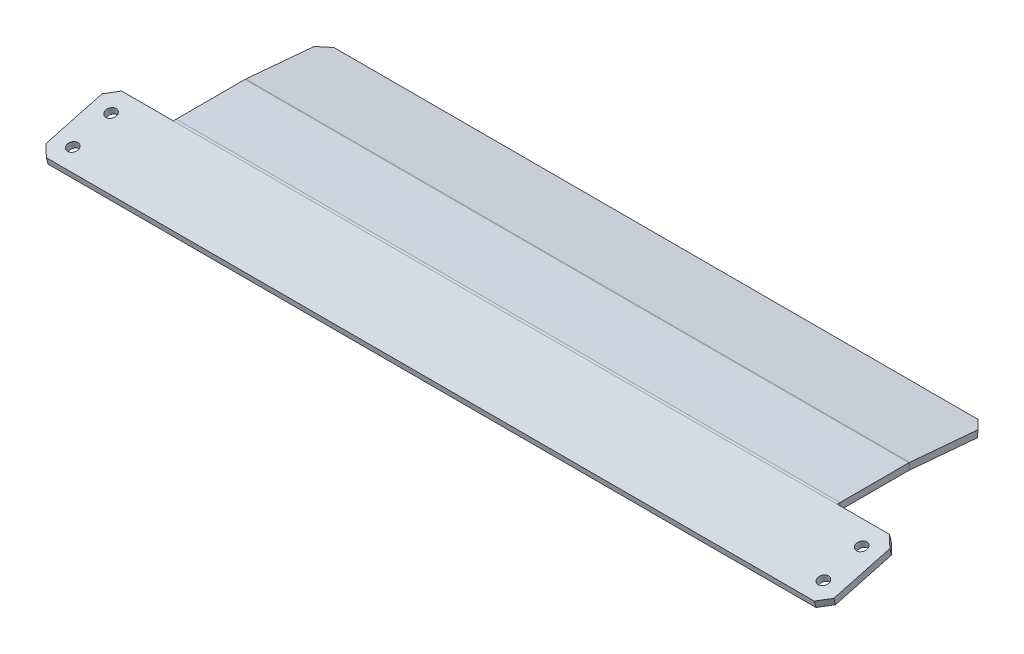
ISO-10303-21;
HEADER;
FILE_DESCRIPTION(('STEP AP214'),'2;1');
FILE_NAME('part.step','',(''),(''),'','','');
FILE_SCHEMA(('AUTOMOTIVE_DESIGN { 1 0 10303 214 1 1 1 1 }'));
ENDSEC;
DATA;
#1=APPLICATION_CONTEXT('core data for automotive mechanical design processes');
#2=APPLICATION_PROTOCOL_DEFINITION('international standard','automotive_design',2000,#1);
#3=PRODUCT_CONTEXT('',#1,'mechanical');
#4=PRODUCT('Part','Part','',(#3));
#5=PRODUCT_RELATED_PRODUCT_CATEGORY('part','',(#4));
#6=PRODUCT_DEFINITION_FORMATION('','',#4);
#7=PRODUCT_DEFINITION_CONTEXT('part definition',#1,'design');
#8=PRODUCT_DEFINITION('design','',#6,#7);
#9=PRODUCT_DEFINITION_SHAPE('','',#8);
#10=(LENGTH_UNIT() NAMED_UNIT(*) SI_UNIT(.MILLI.,.METRE.));
#11=(NAMED_UNIT(*) PLANE_ANGLE_UNIT() SI_UNIT($,.RADIAN.));
#12=(NAMED_UNIT(*) SI_UNIT($,.STERADIAN.) SOLID_ANGLE_UNIT());
#13=UNCERTAINTY_MEASURE_WITH_UNIT(LENGTH_MEASURE(1.E-05),#10,'distance_accuracy_value','');
#14=(GEOMETRIC_REPRESENTATION_CONTEXT(3) GLOBAL_UNCERTAINTY_ASSIGNED_CONTEXT((#13)) GLOBAL_UNIT_ASSIGNED_CONTEXT((#10,
#11,#12)) REPRESENTATION_CONTEXT('',''));
#15=CARTESIAN_POINT('',(0.,0.,0.));
#16=DIRECTION('',(0.,0.,1.));
#17=DIRECTION('',(1.,0.,0.));
#18=AXIS2_PLACEMENT_3D('',#15,#16,#17);
#19=CARTESIAN_POINT('',(0.,-4.2672,0.));
#20=DIRECTION('',(0.,-1.,0.));
#21=DIRECTION('',(0.,0.,-1.));
#22=AXIS2_PLACEMENT_3D('',#19,#20,#21);
#23=PLANE('',#22);
#24=DIRECTION('',(0.,0.,1.));
#25=VECTOR('',#24,1.);
#26=CARTESIAN_POINT('',(-212.725,-4.2672,-22.225));
#27=LINE('',#26,#25);
#28=CARTESIAN_POINT('',(-212.725,-4.2672,-22.1362809640099));
#29=VERTEX_POINT('',#28);
#30=CARTESIAN_POINT('',(-212.725,-4.2672,21.9574821249025));
#31=VERTEX_POINT('',#30);
#32=EDGE_CURVE('E293',#29,#31,#27,.T.);
#33=ORIENTED_EDGE('',*,*,#32,.F.);
#34=DIRECTION('',(1.,0.,0.));
#35=VECTOR('',#34,1.);
#36=CARTESIAN_POINT('',(212.725,-4.2672,-22.1362809640099));
#37=LINE('',#36,#35);
#38=CARTESIAN_POINT('',(212.725,-4.2672,-22.1362809640099));
#39=VERTEX_POINT('',#38);
#40=EDGE_CURVE('E226',#39,#29,#37,.F.);
#41=ORIENTED_EDGE('',*,*,#40,.F.);
#42=DIRECTION('',(0.,0.,-1.));
#43=VECTOR('',#42,1.);
#44=CARTESIAN_POINT('',(212.725,-4.2672,-22.225));
#45=LINE('',#44,#43);
#46=CARTESIAN_POINT('',(212.725,-4.2672,21.9574821249025));
#47=VERTEX_POINT('',#46);
#48=EDGE_CURVE('E295',#47,#39,#45,.T.);
#49=ORIENTED_EDGE('',*,*,#48,.F.);
#50=DIRECTION('',(-1.,0.,0.));
#51=VECTOR('',#50,1.);
#52=CARTESIAN_POINT('',(-212.725,-4.26720000000073,21.9574821249025));
#53=LINE('',#52,#51);
#54=EDGE_CURVE('E274',#31,#47,#53,.F.);
#55=ORIENTED_EDGE('',*,*,#54,.F.);
#56=EDGE_LOOP('',(#33,#41,#49,#55));
#57=FACE_BOUND('',#56,.T.);
#58=ADVANCED_FACE('F38',(#57),#23,.T.);
#59=CARTESIAN_POINT('',(0.,0.,0.));
#60=DIRECTION('',(0.,-1.,0.));
#61=DIRECTION('',(0.,0.,-1.));
#62=AXIS2_PLACEMENT_3D('',#59,#60,#61);
#63=PLANE('',#62);
#64=DIRECTION('',(1.,0.,0.));
#65=VECTOR('',#64,1.);
#66=CARTESIAN_POINT('',(212.725,0.,-22.13628096401));
#67=LINE('',#66,#65);
#68=CARTESIAN_POINT('',(212.725,0.,-22.13628096401));
#69=VERTEX_POINT('',#68);
#70=CARTESIAN_POINT('',(-212.725,0.,-22.1362809640099));
#71=VERTEX_POINT('',#70);
#72=EDGE_CURVE('E187',#69,#71,#67,.F.);
#73=ORIENTED_EDGE('',*,*,#72,.T.);
#74=DIRECTION('',(0.,0.,1.));
#75=VECTOR('',#74,1.);
#76=CARTESIAN_POINT('',(-212.725,0.,-22.225));
#77=LINE('',#76,#75);
#78=CARTESIAN_POINT('',(-212.725,-7.32053306862213E-13,21.9574821249026));
#79=VERTEX_POINT('',#78);
#80=EDGE_CURVE('E290',#71,#79,#77,.T.);
#81=ORIENTED_EDGE('',*,*,#80,.T.);
#82=DIRECTION('',(-1.,0.,0.));
#83=VECTOR('',#82,1.);
#84=CARTESIAN_POINT('',(-212.725,-7.32053306862213E-13,21.9574821249026));
#85=LINE('',#84,#83);
#86=CARTESIAN_POINT('',(212.725,0.,21.9574821249025));
#87=VERTEX_POINT('',#86);
#88=EDGE_CURVE('E260',#79,#87,#85,.F.);
#89=ORIENTED_EDGE('',*,*,#88,.T.);
#90=DIRECTION('',(0.,0.,-1.));
#91=VECTOR('',#90,1.);
#92=CARTESIAN_POINT('',(212.725,0.,-22.225));
#93=LINE('',#92,#91);
#94=EDGE_CURVE('E296',#87,#69,#93,.T.);
#95=ORIENTED_EDGE('',*,*,#94,.T.);
#96=EDGE_LOOP('',(#73,#81,#89,#95));
#97=FACE_BOUND('',#96,.T.);
#98=ADVANCED_FACE('F420',(#97),#63,.F.);
#99=CARTESIAN_POINT('',(212.725,-4.2672,-22.225));
#100=DIRECTION('',(1.,0.,0.));
#101=DIRECTION('',(0.,0.,-1.));
#102=AXIS2_PLACEMENT_3D('',#99,#100,#101);
#103=PLANE('',#102);
#104=ORIENTED_EDGE('',*,*,#48,.T.);
#105=DIRECTION('',(0.,1.,0.));
#106=VECTOR('',#105,1.);
#107=CARTESIAN_POINT('',(212.725,-4.2672,-22.1362809640099));
#108=LINE('',#107,#106);
#109=EDGE_CURVE('E222',#39,#69,#108,.T.);
#110=ORIENTED_EDGE('',*,*,#109,.T.);
#111=ORIENTED_EDGE('',*,*,#94,.F.);
#112=DIRECTION('',(0.,1.,0.));
#113=VECTOR('',#112,1.);
#114=CARTESIAN_POINT('',(212.725,-4.26720000000001,21.9574821249025));
#115=LINE('',#114,#113);
#116=EDGE_CURVE('E281',#47,#87,#115,.T.);
#117=ORIENTED_EDGE('',*,*,#116,.F.);
#118=EDGE_LOOP('',(#104,#110,#111,#117));
#119=FACE_BOUND('',#118,.T.);
#120=ADVANCED_FACE('F426',(#119),#103,.T.);
#121=CARTESIAN_POINT('',(-212.725,-4.2672,-22.225));
#122=DIRECTION('',(-1.,0.,0.));
#123=DIRECTION('',(0.,0.,1.));
#124=AXIS2_PLACEMENT_3D('',#121,#122,#123);
#125=PLANE('',#124);
#126=DIRECTION('',(0.,1.,0.));
#127=VECTOR('',#126,1.);
#128=CARTESIAN_POINT('',(-212.725,-4.2672,-22.1362809640099));
#129=LINE('',#128,#127);
#130=EDGE_CURVE('E230',#29,#71,#129,.T.);
#131=ORIENTED_EDGE('',*,*,#130,.F.);
#132=ORIENTED_EDGE('',*,*,#32,.T.);
#133=DIRECTION('',(0.,1.,0.));
#134=VECTOR('',#133,1.);
#135=CARTESIAN_POINT('',(-212.725,-4.26720000000073,21.9574821249025));
#136=LINE('',#135,#134);
#137=EDGE_CURVE('E265',#31,#79,#136,.T.);
#138=ORIENTED_EDGE('',*,*,#137,.T.);
#139=ORIENTED_EDGE('',*,*,#80,.F.);
#140=EDGE_LOOP('',(#131,#132,#138,#139));
#141=FACE_BOUND('',#140,.T.);
#142=ADVANCED_FACE('F435',(#141),#125,.T.);
#143=CARTESIAN_POINT('',(212.725,-6.29919999999943,21.9574821249025));
#144=DIRECTION('',(1.,0.,0.));
#145=DIRECTION('',(0.,1.,0.));
#146=AXIS2_PLACEMENT_3D('',#143,#144,#145);
#147=PLANE('',#146);
#148=DIRECTION('',(0.,0.96592582628907,0.258819045102515));
#149=VECTOR('',#148,1.);
#150=CARTESIAN_POINT('',(212.725,-4.3364387209806,22.4834024245506));
#151=LINE('',#150,#149);
#152=CARTESIAN_POINT('',(212.725,-4.3364387209806,22.4834024245506));
#153=VERTEX_POINT('',#152);
#154=CARTESIAN_POINT('',(212.725,-0.214640035039874,23.5878350538121));
#155=VERTEX_POINT('',#154);
#156=EDGE_CURVE('E284',#153,#155,#151,.T.);
#157=ORIENTED_EDGE('',*,*,#156,.F.);
#158=CARTESIAN_POINT('',(212.725,-6.29919999999943,21.9574821249025));
#159=DIRECTION('',(-1.,0.,0.));
#160=DIRECTION('',(0.,-1.,0.));
#161=AXIS2_PLACEMENT_3D('',#158,#159,#160);
#162=CIRCLE('',#161,2.03199999999942);
#163=EDGE_CURVE('E269',#47,#153,#162,.F.);
#164=ORIENTED_EDGE('',*,*,#163,.F.);
#165=ORIENTED_EDGE('',*,*,#116,.T.);
#166=CARTESIAN_POINT('',(212.725,-6.29919999999943,21.9574821249025));
#167=DIRECTION('',(-1.,0.,0.));
#168=DIRECTION('',(0.,-1.,0.));
#169=AXIS2_PLACEMENT_3D('',#166,#167,#168);
#170=CIRCLE('',#169,6.29919999999942);
#171=EDGE_CURVE('E262',#87,#155,#170,.F.);
#172=ORIENTED_EDGE('',*,*,#171,.T.);
#173=EDGE_LOOP('',(#157,#164,#165,#172));
#174=FACE_BOUND('',#173,.T.);
#175=ADVANCED_FACE('F439',(#174),#147,.T.);
#176=CARTESIAN_POINT('',(-212.725,-6.29920000000015,21.9574821249025));
#177=DIRECTION('',(1.,0.,0.));
#178=DIRECTION('',(0.,1.,0.));
#179=AXIS2_PLACEMENT_3D('',#176,#177,#178);
#180=PLANE('',#179);
#181=CARTESIAN_POINT('',(-212.725,-6.29920000000015,21.9574821249025));
#182=DIRECTION('',(-1.,0.,0.));
#183=DIRECTION('',(0.,-1.,0.));
#184=AXIS2_PLACEMENT_3D('',#181,#182,#183);
#185=CIRCLE('',#184,2.03199999999942);
#186=CARTESIAN_POINT('',(-212.725,-4.33643872098132,22.4834024245506));
#187=VERTEX_POINT('',#186);
#188=EDGE_CURVE('E277',#187,#31,#185,.T.);
#189=ORIENTED_EDGE('',*,*,#188,.F.);
#190=DIRECTION('',(0.,0.96592582628907,0.258819045102515));
#191=VECTOR('',#190,1.);
#192=CARTESIAN_POINT('',(-212.725,-4.33643872098132,22.4834024245506));
#193=LINE('',#192,#191);
#194=CARTESIAN_POINT('',(-212.725,-0.214640035040604,23.5878350538121));
#195=VERTEX_POINT('',#194);
#196=EDGE_CURVE('E287',#187,#195,#193,.T.);
#197=ORIENTED_EDGE('',*,*,#196,.T.);
#198=CARTESIAN_POINT('',(-212.725,-6.29920000000015,21.9574821249025));
#199=DIRECTION('',(-1.,0.,0.));
#200=DIRECTION('',(0.,-1.,0.));
#201=AXIS2_PLACEMENT_3D('',#198,#199,#200);
#202=CIRCLE('',#201,6.29919999999942);
#203=EDGE_CURVE('E263',#195,#79,#202,.T.);
#204=ORIENTED_EDGE('',*,*,#203,.T.);
#205=ORIENTED_EDGE('',*,*,#137,.F.);
#206=EDGE_LOOP('',(#189,#197,#204,#205));
#207=FACE_BOUND('',#206,.T.);
#208=ADVANCED_FACE('F385',(#207),#180,.F.);
#209=CARTESIAN_POINT('',(-212.725,-6.29920000000015,21.9574821249025));
#210=DIRECTION('',(-1.,0.,0.));
#211=DIRECTION('',(0.,0.96592582628907,0.258819045102515));
#212=AXIS2_PLACEMENT_3D('',#209,#210,#211);
#213=CYLINDRICAL_SURFACE('',#212,6.29919999999942);
#214=ORIENTED_EDGE('',*,*,#88,.F.);
#215=ORIENTED_EDGE('',*,*,#203,.F.);
#216=DIRECTION('',(-1.,0.,0.));
#217=VECTOR('',#216,1.);
#218=CARTESIAN_POINT('',(-212.725,-0.214640035040604,23.5878350538121));
#219=LINE('',#218,#217);
#220=EDGE_CURVE('E266',#155,#195,#219,.T.);
#221=ORIENTED_EDGE('',*,*,#220,.F.);
#222=ORIENTED_EDGE('',*,*,#171,.F.);
#223=EDGE_LOOP('',(#214,#215,#221,#222));
#224=FACE_BOUND('',#223,.T.);
#225=ADVANCED_FACE('F381',(#224),#213,.T.);
#226=CARTESIAN_POINT('',(-212.725,-6.29920000000015,21.9574821249025));
#227=DIRECTION('',(-1.,0.,0.));
#228=DIRECTION('',(0.,0.96592582628907,0.258819045102515));
#229=AXIS2_PLACEMENT_3D('',#226,#227,#228);
#230=CYLINDRICAL_SURFACE('',#229,2.03199999999942);
#231=ORIENTED_EDGE('',*,*,#54,.T.);
#232=ORIENTED_EDGE('',*,*,#163,.T.);
#233=DIRECTION('',(-1.,0.,0.));
#234=VECTOR('',#233,1.);
#235=CARTESIAN_POINT('',(-212.725,-4.33643872098132,22.4834024245506));
#236=LINE('',#235,#234);
#237=EDGE_CURVE('E252',#153,#187,#236,.T.);
#238=ORIENTED_EDGE('',*,*,#237,.T.);
#239=ORIENTED_EDGE('',*,*,#188,.T.);
#240=EDGE_LOOP('',(#231,#232,#238,#239));
#241=FACE_BOUND('',#240,.T.);
#242=ADVANCED_FACE('F508',(#241),#230,.F.);
#243=CARTESIAN_POINT('',(252.4125,-4.33643872098059,22.4834024245506));
#244=DIRECTION('',(0.,0.258819045102514,-0.96592582628907));
#245=DIRECTION('',(0.,0.96592582628907,0.258819045102515));
#246=AXIS2_PLACEMENT_3D('',#243,#244,#245);
#247=PLANE('',#246);
#248=DIRECTION('',(-1.,0.,0.));
#249=VECTOR('',#248,1.);
#250=CARTESIAN_POINT('',(252.4125,-4.33643872098059,22.4834024245506));
#251=LINE('',#250,#249);
#252=CARTESIAN_POINT('',(-246.0625,-4.33643872098066,22.4834024245508));
#253=VERTEX_POINT('',#252);
#254=EDGE_CURVE('E233',#187,#253,#251,.T.);
#255=ORIENTED_EDGE('',*,*,#254,.T.);
#256=DIRECTION('',(0.,0.96592582628907,0.258819045102515));
#257=VECTOR('',#256,1.);
#258=CARTESIAN_POINT('',(-246.0625,-0.214640035039926,23.5878350538123));
#259=LINE('',#258,#257);
#260=CARTESIAN_POINT('',(-246.0625,-0.214640035039917,23.5878350538123));
#261=VERTEX_POINT('',#260);
#262=EDGE_CURVE('E326',#253,#261,#259,.T.);
#263=ORIENTED_EDGE('',*,*,#262,.T.);
#264=DIRECTION('',(1.,0.,0.));
#265=VECTOR('',#264,1.);
#266=CARTESIAN_POINT('',(0.,-0.214640035039894,23.5878350538122));
#267=LINE('',#266,#265);
#268=EDGE_CURVE('E239',#261,#195,#267,.T.);
#269=ORIENTED_EDGE('',*,*,#268,.T.);
#270=ORIENTED_EDGE('',*,*,#196,.F.);
#271=EDGE_LOOP('',(#255,#263,#269,#270));
#272=FACE_BOUND('',#271,.T.);
#273=ADVANCED_FACE('F390',(#272),#247,.T.);
#274=CARTESIAN_POINT('',(-252.4125,-0.145401314059282,23.3294326292615));
#275=DIRECTION('',(1.,0.,0.));
#276=DIRECTION('',(0.,0.,-1.));
#277=AXIS2_PLACEMENT_3D('',#274,#275,#276);
#278=PLANE('',#277);
#279=DIRECTION('',(0.,-0.258819045102515,0.96592582628907));
#280=VECTOR('',#279,1.);
#281=CARTESIAN_POINT('',(-252.4125,-4.2672,22.225));
#282=LINE('',#281,#280);
#283=CARTESIAN_POINT('',(-252.4125,-5.97993965738159,28.6170314214864));
#284=VERTEX_POINT('',#283);
#285=CARTESIAN_POINT('',(-252.4125,-15.6094283025084,64.5547722960083));
#286=VERTEX_POINT('',#285);
#287=EDGE_CURVE('E241',#284,#286,#282,.T.);
#288=ORIENTED_EDGE('',*,*,#287,.T.);
#289=DIRECTION('',(0.,0.96592582628907,0.258819045102515));
#290=VECTOR('',#289,1.);
#291=CARTESIAN_POINT('',(-252.4125,-11.4876296165677,65.6592049252697));
#292=LINE('',#291,#290);
#293=CARTESIAN_POINT('',(-252.4125,-11.4876296165677,65.6592049252697));
#294=VERTEX_POINT('',#293);
#295=EDGE_CURVE('E316',#286,#294,#292,.T.);
#296=ORIENTED_EDGE('',*,*,#295,.T.);
#297=DIRECTION('',(0.,-0.258819045102515,0.96592582628907));
#298=VECTOR('',#297,1.);
#299=CARTESIAN_POINT('',(-252.4125,-0.145401314059282,23.3294326292615));
#300=LINE('',#299,#298);
#301=CARTESIAN_POINT('',(-252.4125,-1.85814097144087,29.7214640507478));
#302=VERTEX_POINT('',#301);
#303=EDGE_CURVE('E242',#302,#294,#300,.T.);
#304=ORIENTED_EDGE('',*,*,#303,.F.);
#305=DIRECTION('',(0.,-0.96592582628907,-0.258819045102515));
#306=VECTOR('',#305,1.);
#307=CARTESIAN_POINT('',(-252.4125,-5.97993965738161,28.6170314214864));
#308=LINE('',#307,#306);
#309=EDGE_CURVE('E314',#302,#284,#308,.T.);
#310=ORIENTED_EDGE('',*,*,#309,.T.);
#311=EDGE_LOOP('',(#288,#296,#304,#310));
#312=FACE_BOUND('',#311,.T.);
#313=ADVANCED_FACE('F400',(#312),#278,.F.);
#314=CARTESIAN_POINT('',(252.4125,-0.145401314059258,23.3294326292613));
#315=DIRECTION('',(-1.,0.,0.));
#316=DIRECTION('',(0.,-1.,0.));
#317=AXIS2_PLACEMENT_3D('',#314,#315,#316);
#318=PLANE('',#317);
#319=DIRECTION('',(0.,0.258819045102515,-0.96592582628907));
#320=VECTOR('',#319,1.);
#321=CARTESIAN_POINT('',(252.4125,-4.26719999999998,22.2249999999999));
#322=LINE('',#321,#320);
#323=CARTESIAN_POINT('',(252.4125,-15.6094283025085,64.5547722960084));
#324=VERTEX_POINT('',#323);
#325=CARTESIAN_POINT('',(252.4125,-5.97993965738154,28.6170314214862));
#326=VERTEX_POINT('',#325);
#327=EDGE_CURVE('E246',#324,#326,#322,.T.);
#328=ORIENTED_EDGE('',*,*,#327,.T.);
#329=DIRECTION('',(0.,0.96592582628907,0.258819045102515));
#330=VECTOR('',#329,1.);
#331=CARTESIAN_POINT('',(252.4125,-1.85814097144081,29.7214640507476));
#332=LINE('',#331,#330);
#333=CARTESIAN_POINT('',(252.4125,-1.85814097144082,29.7214640507476));
#334=VERTEX_POINT('',#333);
#335=EDGE_CURVE('E47',#326,#334,#332,.T.);
#336=ORIENTED_EDGE('',*,*,#335,.T.);
#337=DIRECTION('',(0.,0.258819045102515,-0.96592582628907));
#338=VECTOR('',#337,1.);
#339=CARTESIAN_POINT('',(252.4125,-0.145401314059258,23.3294326292613));
#340=LINE('',#339,#338);
#341=CARTESIAN_POINT('',(252.4125,-11.4876296165678,65.6592049252699));
#342=VERTEX_POINT('',#341);
#343=EDGE_CURVE('E249',#342,#334,#340,.T.);
#344=ORIENTED_EDGE('',*,*,#343,.F.);
#345=DIRECTION('',(0.,-0.96592582628907,-0.258819045102515));
#346=VECTOR('',#345,1.);
#347=CARTESIAN_POINT('',(252.4125,-11.4876296165678,65.6592049252699));
#348=LINE('',#347,#346);
#349=EDGE_CURVE('E345',#342,#324,#348,.T.);
#350=ORIENTED_EDGE('',*,*,#349,.T.);
#351=EDGE_LOOP('',(#328,#336,#344,#350));
#352=FACE_BOUND('',#351,.T.);
#353=ADVANCED_FACE('F352',(#352),#318,.F.);
#354=CARTESIAN_POINT('',(0.,5.6966968844261,1.52642532970683));
#355=DIRECTION('',(0.,-0.96592582628907,-0.258819045102515));
#356=DIRECTION('',(0.,0.258819045102515,-0.96592582628907));
#357=AXIS2_PLACEMENT_3D('',#354,#355,#356);
#358=PLANE('',#357);
#359=CARTESIAN_POINT('',(-240.50625,-3.50164190784185,35.8550930476835));
#360=DIRECTION('',(0.,0.96592582628907,0.258819045102515));
#361=DIRECTION('',(0.,-0.258819045102515,0.96592582628907));
#362=AXIS2_PLACEMENT_3D('',#359,#360,#361);
#363=CIRCLE('',#362,3.373501);
#364=CARTESIAN_POINT('',(-240.50625,-4.37476821531423,39.1136447885955));
#365=VERTEX_POINT('',#364);
#366=EDGE_CURVE('E548',#365,#365,#363,.T.);
#367=ORIENTED_EDGE('',*,*,#366,.F.);
#368=EDGE_LOOP('',(#367));
#369=FACE_BOUND('',#368,.T.);
#370=CARTESIAN_POINT('',(-240.50625,-10.0756456534457,60.3896090354259));
#371=DIRECTION('',(0.,0.96592582628907,0.258819045102515));
#372=DIRECTION('',(0.,-0.258819045102515,0.96592582628907));
#373=AXIS2_PLACEMENT_3D('',#370,#371,#372);
#374=CIRCLE('',#373,3.373501);
#375=CARTESIAN_POINT('',(-240.50625,-10.9487719609181,63.6481607763379));
#376=VERTEX_POINT('',#375);
#377=EDGE_CURVE('E545',#376,#376,#374,.T.);
#378=ORIENTED_EDGE('',*,*,#377,.F.);
#379=EDGE_LOOP('',(#378));
#380=FACE_BOUND('',#379,.T.);
#381=CARTESIAN_POINT('',(240.50625,-10.0756456534457,60.3896090354259));
#382=DIRECTION('',(0.,0.96592582628907,0.258819045102515));
#383=DIRECTION('',(0.,-0.258819045102515,0.96592582628907));
#384=AXIS2_PLACEMENT_3D('',#381,#382,#383);
#385=CIRCLE('',#384,3.373501);
#386=CARTESIAN_POINT('',(240.50625,-10.9487719609181,63.6481607763379));
#387=VERTEX_POINT('',#386);
#388=EDGE_CURVE('E539',#387,#387,#385,.T.);
#389=ORIENTED_EDGE('',*,*,#388,.F.);
#390=EDGE_LOOP('',(#389));
#391=FACE_BOUND('',#390,.T.);
#392=CARTESIAN_POINT('',(240.50625,-3.50164190784187,35.8550930476835));
#393=DIRECTION('',(0.,0.96592582628907,0.258819045102515));
#394=DIRECTION('',(0.,-0.258819045102515,0.96592582628907));
#395=AXIS2_PLACEMENT_3D('',#392,#393,#394);
#396=CIRCLE('',#395,3.373501);
#397=CARTESIAN_POINT('',(240.50625,-4.37476821531425,39.1136447885955));
#398=VERTEX_POINT('',#397);
#399=EDGE_CURVE('E533',#398,#398,#396,.T.);
#400=ORIENTED_EDGE('',*,*,#399,.F.);
#401=EDGE_LOOP('',(#400));
#402=FACE_BOUND('',#401,.T.);
#403=ORIENTED_EDGE('',*,*,#303,.T.);
#404=DIRECTION('',(-0.707106781186545,0.183012701892215,-0.683012701892223));
#405=VECTOR('',#404,1.);
#406=CARTESIAN_POINT('',(-246.0625,-13.1311305529687,71.7928339222055));
#407=LINE('',#406,#405);
#408=CARTESIAN_POINT('',(-246.0625,-13.1311305529687,71.7928339222055));
#409=VERTEX_POINT('',#408);
#410=EDGE_CURVE('E324',#294,#409,#407,.F.);
#411=ORIENTED_EDGE('',*,*,#410,.T.);
#412=DIRECTION('',(1.,0.,0.));
#413=VECTOR('',#412,1.);
#414=CARTESIAN_POINT('',(252.4125,-13.1311305529687,71.7928339222054));
#415=LINE('',#414,#413);
#416=CARTESIAN_POINT('',(246.0625,-13.1311305529687,71.7928339222054));
#417=VERTEX_POINT('',#416);
#418=EDGE_CURVE('E245',#409,#417,#415,.T.);
#419=ORIENTED_EDGE('',*,*,#418,.T.);
#420=DIRECTION('',(-0.707106781186551,-0.183012701892214,0.683012701892217));
#421=VECTOR('',#420,1.);
#422=CARTESIAN_POINT('',(252.4125,-11.4876296165678,65.6592049252699));
#423=LINE('',#422,#421);
#424=EDGE_CURVE('E318',#417,#342,#423,.F.);
#425=ORIENTED_EDGE('',*,*,#424,.T.);
#426=ORIENTED_EDGE('',*,*,#343,.T.);
#427=DIRECTION('',(-0.707106781186551,0.183012701892214,-0.683012701892218));
#428=VECTOR('',#427,1.);
#429=CARTESIAN_POINT('',(252.4125,-1.85814097144082,29.7214640507476));
#430=LINE('',#429,#428);
#431=CARTESIAN_POINT('',(246.0625,-0.214640035039871,23.5878350538121));
#432=VERTEX_POINT('',#431);
#433=EDGE_CURVE('E320',#334,#432,#430,.T.);
#434=ORIENTED_EDGE('',*,*,#433,.T.);
#435=EDGE_CURVE('E238',#155,#432,#267,.T.);
#436=ORIENTED_EDGE('',*,*,#435,.F.);
#437=ORIENTED_EDGE('',*,*,#220,.T.);
#438=ORIENTED_EDGE('',*,*,#268,.F.);
#439=DIRECTION('',(-0.707106781186546,-0.183012701892215,0.683012701892222));
#440=VECTOR('',#439,1.);
#441=CARTESIAN_POINT('',(-246.0625,-0.214640035039917,23.5878350538123));
#442=LINE('',#441,#440);
#443=EDGE_CURVE('E322',#261,#302,#442,.T.);
#444=ORIENTED_EDGE('',*,*,#443,.T.);
#445=EDGE_LOOP('',(#403,#411,#419,#425,#426,#434,#436,#437,#438,#444));
#446=FACE_BOUND('',#445,.T.);
#447=ADVANCED_FACE('F358',(#369,#380,#391,#402,#446),#358,.F.);
#448=CARTESIAN_POINT('',(0.,1.57489819848538,0.421992700445377));
#449=DIRECTION('',(0.,-0.96592582628907,-0.258819045102515));
#450=DIRECTION('',(0.,0.258819045102515,-0.96592582628907));
#451=AXIS2_PLACEMENT_3D('',#448,#449,#450);
#452=PLANE('',#451);
#453=CARTESIAN_POINT('',(-240.50625,-7.62344059378257,34.750660418422));
#454=DIRECTION('',(0.,-0.96592582628907,-0.258819045102515));
#455=DIRECTION('',(0.,0.258819045102515,-0.96592582628907));
#456=AXIS2_PLACEMENT_3D('',#453,#454,#455);
#457=CIRCLE('',#456,3.373501);
#458=CARTESIAN_POINT('',(-240.50625,-6.75031428631019,31.49210867751));
#459=VERTEX_POINT('',#458);
#460=EDGE_CURVE('E42',#459,#459,#457,.T.);
#461=ORIENTED_EDGE('',*,*,#460,.F.);
#462=EDGE_LOOP('',(#461));
#463=FACE_BOUND('',#462,.T.);
#464=CARTESIAN_POINT('',(-240.50625,-14.1974443393864,59.2851764061644));
#465=DIRECTION('',(0.,-0.96592582628907,-0.258819045102515));
#466=DIRECTION('',(0.,0.258819045102515,-0.96592582628907));
#467=AXIS2_PLACEMENT_3D('',#464,#465,#466);
#468=CIRCLE('',#467,3.373501);
#469=CARTESIAN_POINT('',(-240.50625,-13.3243180319141,56.0266246652524));
#470=VERTEX_POINT('',#469);
#471=EDGE_CURVE('E542',#470,#470,#468,.T.);
#472=ORIENTED_EDGE('',*,*,#471,.F.);
#473=EDGE_LOOP('',(#472));
#474=FACE_BOUND('',#473,.T.);
#475=CARTESIAN_POINT('',(240.50625,-14.1974443393865,59.2851764061644));
#476=DIRECTION('',(0.,-0.96592582628907,-0.258819045102515));
#477=DIRECTION('',(0.,0.258819045102515,-0.96592582628907));
#478=AXIS2_PLACEMENT_3D('',#475,#476,#477);
#479=CIRCLE('',#478,3.373501);
#480=CARTESIAN_POINT('',(240.50625,-13.3243180319141,56.0266246652524));
#481=VERTEX_POINT('',#480);
#482=EDGE_CURVE('E536',#481,#481,#479,.T.);
#483=ORIENTED_EDGE('',*,*,#482,.F.);
#484=EDGE_LOOP('',(#483));
#485=FACE_BOUND('',#484,.T.);
#486=CARTESIAN_POINT('',(240.50625,-7.62344059378259,34.750660418422));
#487=DIRECTION('',(0.,-0.96592582628907,-0.258819045102515));
#488=DIRECTION('',(0.,0.258819045102515,-0.96592582628907));
#489=AXIS2_PLACEMENT_3D('',#486,#487,#488);
#490=CIRCLE('',#489,3.373501);
#491=CARTESIAN_POINT('',(240.50625,-6.75031428631021,31.49210867751));
#492=VERTEX_POINT('',#491);
#493=EDGE_CURVE('E529',#492,#492,#490,.T.);
#494=ORIENTED_EDGE('',*,*,#493,.F.);
#495=EDGE_LOOP('',(#494));
#496=FACE_BOUND('',#495,.T.);
#497=DIRECTION('',(1.,0.,0.));
#498=VECTOR('',#497,1.);
#499=CARTESIAN_POINT('',(252.4125,-17.2529292389094,70.688401292944));
#500=LINE('',#499,#498);
#501=CARTESIAN_POINT('',(-246.0625,-17.2529292389094,70.688401292944));
#502=VERTEX_POINT('',#501);
#503=CARTESIAN_POINT('',(246.0625,-17.2529292389094,70.688401292944));
#504=VERTEX_POINT('',#503);
#505=EDGE_CURVE('E255',#502,#504,#500,.T.);
#506=ORIENTED_EDGE('',*,*,#505,.F.);
#507=DIRECTION('',(0.707106781186545,-0.183012701892215,0.683012701892223));
#508=VECTOR('',#507,1.);
#509=CARTESIAN_POINT('',(-159.403819549389,-39.6818461629807,154.394258812322));
#510=LINE('',#509,#508);
#511=EDGE_CURVE('E312',#502,#286,#510,.F.);
#512=ORIENTED_EDGE('',*,*,#511,.T.);
#513=ORIENTED_EDGE('',*,*,#287,.F.);
#514=DIRECTION('',(0.707106781186546,0.183012701892215,-0.683012701892222));
#515=VECTOR('',#514,1.);
#516=CARTESIAN_POINT('',(-111.611424003184,30.4620603815211,-107.386364253129));
#517=LINE('',#516,#515);
#518=EDGE_CURVE('E310',#284,#253,#517,.T.);
#519=ORIENTED_EDGE('',*,*,#518,.T.);
#520=ORIENTED_EDGE('',*,*,#254,.F.);
#521=ORIENTED_EDGE('',*,*,#237,.F.);
#522=CARTESIAN_POINT('',(246.0625,-4.33643872098059,22.4834024245506));
#523=VERTEX_POINT('',#522);
#524=EDGE_CURVE('E236',#523,#153,#251,.T.);
#525=ORIENTED_EDGE('',*,*,#524,.F.);
#526=DIRECTION('',(0.707106781186551,-0.183012701892214,0.683012701892218));
#527=VECTOR('',#526,1.);
#528=CARTESIAN_POINT('',(111.611424003182,30.4620603815211,-107.386364253129));
#529=LINE('',#528,#527);
#530=EDGE_CURVE('E308',#523,#326,#529,.T.);
#531=ORIENTED_EDGE('',*,*,#530,.T.);
#532=ORIENTED_EDGE('',*,*,#327,.F.);
#533=DIRECTION('',(0.707106781186551,0.183012701892214,-0.683012701892217));
#534=VECTOR('',#533,1.);
#535=CARTESIAN_POINT('',(159.403819549387,-39.6818461629809,154.394258812322));
#536=LINE('',#535,#534);
#537=EDGE_CURVE('E306',#324,#504,#536,.F.);
#538=ORIENTED_EDGE('',*,*,#537,.T.);
#539=EDGE_LOOP('',(#506,#512,#513,#519,#520,#521,#525,#531,#532,#538));
#540=FACE_BOUND('',#539,.T.);
#541=ADVANCED_FACE('F367',(#463,#474,#485,#496,#540),#452,.T.);
#542=CARTESIAN_POINT('',(252.4125,-13.1311305529687,71.7928339222054));
#543=DIRECTION('',(0.,0.258819045102515,-0.96592582628907));
#544=DIRECTION('',(0.,0.96592582628907,0.258819045102515));
#545=AXIS2_PLACEMENT_3D('',#542,#543,#544);
#546=PLANE('',#545);
#547=ORIENTED_EDGE('',*,*,#418,.F.);
#548=DIRECTION('',(0.,-0.96592582628907,-0.258819045102515));
#549=VECTOR('',#548,1.);
#550=CARTESIAN_POINT('',(-246.0625,-13.1311305529687,71.7928339222055));
#551=LINE('',#550,#549);
#552=EDGE_CURVE('E303',#409,#502,#551,.T.);
#553=ORIENTED_EDGE('',*,*,#552,.T.);
#554=ORIENTED_EDGE('',*,*,#505,.T.);
#555=DIRECTION('',(0.,0.96592582628907,0.258819045102515));
#556=VECTOR('',#555,1.);
#557=CARTESIAN_POINT('',(246.0625,-13.1311305529687,71.7928339222054));
#558=LINE('',#557,#556);
#559=EDGE_CURVE('E299',#504,#417,#558,.T.);
#560=ORIENTED_EDGE('',*,*,#559,.T.);
#561=EDGE_LOOP('',(#547,#553,#554,#560));
#562=FACE_BOUND('',#561,.T.);
#563=ADVANCED_FACE('F406',(#562),#546,.F.);
#564=ORIENTED_EDGE('',*,*,#435,.T.);
#565=DIRECTION('',(0.,-0.96592582628907,-0.258819045102515));
#566=VECTOR('',#565,1.);
#567=CARTESIAN_POINT('',(246.0625,-4.33643872098059,22.4834024245506));
#568=LINE('',#567,#566);
#569=EDGE_CURVE('E11',#432,#523,#568,.T.);
#570=ORIENTED_EDGE('',*,*,#569,.T.);
#571=ORIENTED_EDGE('',*,*,#524,.T.);
#572=ORIENTED_EDGE('',*,*,#156,.T.);
#573=EDGE_LOOP('',(#564,#570,#571,#572));
#574=FACE_BOUND('',#573,.T.);
#575=ADVANCED_FACE('F373',(#574),#247,.T.);
#576=CARTESIAN_POINT('',(-212.725,-6.29919999999997,-22.1362809640099));
#577=DIRECTION('',(-1.,0.,0.));
#578=DIRECTION('',(0.,0.,1.));
#579=AXIS2_PLACEMENT_3D('',#576,#577,#578);
#580=PLANE('',#579);
#581=DIRECTION('',(0.,0.996194698091746,-0.0871557427476516));
#582=VECTOR('',#581,1.);
#583=CARTESIAN_POINT('',(-212.725,-4.27493237347757,-22.3133814332731));
#584=LINE('',#583,#582);
#585=CARTESIAN_POINT('',(-212.725,-4.27493237347757,-22.3133814332731));
#586=VERTEX_POINT('',#585);
#587=CARTESIAN_POINT('',(-212.725,-0.0239703577804735,-22.6852924187259));
#588=VERTEX_POINT('',#587);
#589=EDGE_CURVE('E526',#586,#588,#584,.T.);
#590=ORIENTED_EDGE('',*,*,#589,.F.);
#591=CARTESIAN_POINT('',(-212.725,-6.29919999999997,-22.1362809640099));
#592=DIRECTION('',(1.,0.,0.));
#593=DIRECTION('',(0.,0.,-1.));
#594=AXIS2_PLACEMENT_3D('',#591,#592,#593);
#595=CIRCLE('',#594,2.03199999999996);
#596=EDGE_CURVE('E190',#29,#586,#595,.F.);
#597=ORIENTED_EDGE('',*,*,#596,.F.);
#598=ORIENTED_EDGE('',*,*,#130,.T.);
#599=CARTESIAN_POINT('',(-212.725,-6.29919999999997,-22.1362809640099));
#600=DIRECTION('',(1.,0.,0.));
#601=DIRECTION('',(0.,0.,-1.));
#602=AXIS2_PLACEMENT_3D('',#599,#600,#601);
#603=CIRCLE('',#602,6.29919999999997);
#604=EDGE_CURVE('E221',#71,#588,#603,.F.);
#605=ORIENTED_EDGE('',*,*,#604,.T.);
#606=EDGE_LOOP('',(#590,#597,#598,#605));
#607=FACE_BOUND('',#606,.T.);
#608=ADVANCED_FACE('F413',(#607),#580,.T.);
#609=CARTESIAN_POINT('',(212.725,-6.29919999999997,-22.1362809640099));
#610=DIRECTION('',(-1.,0.,0.));
#611=DIRECTION('',(0.,0.,1.));
#612=AXIS2_PLACEMENT_3D('',#609,#610,#611);
#613=PLANE('',#612);
#614=CARTESIAN_POINT('',(212.725,-6.29919999999997,-22.1362809640099));
#615=DIRECTION('',(1.,0.,0.));
#616=DIRECTION('',(0.,0.,-1.));
#617=AXIS2_PLACEMENT_3D('',#614,#615,#616);
#618=CIRCLE('',#617,2.03199999999996);
#619=CARTESIAN_POINT('',(212.725,-4.27493237347757,-22.3133814332731));
#620=VERTEX_POINT('',#619);
#621=EDGE_CURVE('E197',#620,#39,#618,.T.);
#622=ORIENTED_EDGE('',*,*,#621,.F.);
#623=DIRECTION('',(0.,0.996194698091746,-0.0871557427476516));
#624=VECTOR('',#623,1.);
#625=CARTESIAN_POINT('',(212.725,-4.27493237347757,-22.3133814332732));
#626=LINE('',#625,#624);
#627=CARTESIAN_POINT('',(212.725,-0.0239703577804753,-22.6852924187259));
#628=VERTEX_POINT('',#627);
#629=EDGE_CURVE('E194',#620,#628,#626,.T.);
#630=ORIENTED_EDGE('',*,*,#629,.T.);
#631=CARTESIAN_POINT('',(212.725,-6.29919999999997,-22.1362809640099));
#632=DIRECTION('',(1.,0.,0.));
#633=DIRECTION('',(0.,0.,-1.));
#634=AXIS2_PLACEMENT_3D('',#631,#632,#633);
#635=CIRCLE('',#634,6.29919999999997);
#636=EDGE_CURVE('E180',#628,#69,#635,.T.);
#637=ORIENTED_EDGE('',*,*,#636,.T.);
#638=ORIENTED_EDGE('',*,*,#109,.F.);
#639=EDGE_LOOP('',(#622,#630,#637,#638));
#640=FACE_BOUND('',#639,.T.);
#641=ADVANCED_FACE('F195',(#640),#613,.F.);
#642=CARTESIAN_POINT('',(212.725,-6.29919999999997,-22.1362809640099));
#643=DIRECTION('',(1.,0.,0.));
#644=DIRECTION('',(0.,0.996194698091746,-0.0871557427476516));
#645=AXIS2_PLACEMENT_3D('',#642,#643,#644);
#646=CYLINDRICAL_SURFACE('',#645,6.29919999999997);
#647=ORIENTED_EDGE('',*,*,#72,.F.);
#648=ORIENTED_EDGE('',*,*,#636,.F.);
#649=DIRECTION('',(-1.,0.,0.));
#650=VECTOR('',#649,1.);
#651=CARTESIAN_POINT('',(0.,-0.0239703577804727,-22.6852924187259));
#652=LINE('',#651,#650);
#653=EDGE_CURVE('E185',#628,#588,#652,.T.);
#654=ORIENTED_EDGE('',*,*,#653,.T.);
#655=ORIENTED_EDGE('',*,*,#604,.F.);
#656=EDGE_LOOP('',(#647,#648,#654,#655));
#657=FACE_BOUND('',#656,.T.);
#658=ADVANCED_FACE('F182',(#657),#646,.T.);
#659=CARTESIAN_POINT('',(212.725,-6.29919999999997,-22.1362809640099));
#660=DIRECTION('',(1.,0.,0.));
#661=DIRECTION('',(0.,0.996194698091746,-0.0871557427476516));
#662=AXIS2_PLACEMENT_3D('',#659,#660,#661);
#663=CYLINDRICAL_SURFACE('',#662,2.03199999999996);
#664=ORIENTED_EDGE('',*,*,#40,.T.);
#665=ORIENTED_EDGE('',*,*,#596,.T.);
#666=DIRECTION('',(1.,0.,0.));
#667=VECTOR('',#666,1.);
#668=CARTESIAN_POINT('',(-212.725,-4.27493237347757,-22.3133814332731));
#669=LINE('',#668,#667);
#670=EDGE_CURVE('E199',#586,#620,#669,.T.);
#671=ORIENTED_EDGE('',*,*,#670,.T.);
#672=ORIENTED_EDGE('',*,*,#621,.T.);
#673=EDGE_LOOP('',(#664,#665,#671,#672));
#674=FACE_BOUND('',#673,.T.);
#675=ADVANCED_FACE('F487',(#674),#663,.F.);
#676=CARTESIAN_POINT('',(-212.725,-4.40743498924534,-72.7885224236777));
#677=DIRECTION('',(1.,0.,0.));
#678=DIRECTION('',(0.,1.,0.));
#679=AXIS2_PLACEMENT_3D('',#676,#677,#678);
#680=PLANE('',#679);
#681=DIRECTION('',(0.,0.0871557427476516,0.996194698091746));
#682=VECTOR('',#681,1.);
#683=CARTESIAN_POINT('',(-212.725,-4.40743498924534,-72.7885224236777));
#684=LINE('',#683,#682);
#685=CARTESIAN_POINT('',(-212.725,-3.85399602279777,-66.4626860907953));
#686=VERTEX_POINT('',#685);
#687=EDGE_CURVE('E206',#686,#588,#684,.T.);
#688=ORIENTED_EDGE('',*,*,#687,.F.);
#689=DIRECTION('',(0.,-0.996194698091746,0.0871557427476516));
#690=VECTOR('',#689,1.);
#691=CARTESIAN_POINT('',(-212.725,-3.85399602279777,-66.4626860907953));
#692=LINE('',#691,#690);
#693=CARTESIAN_POINT('',(-212.725,-8.10495803849487,-66.0907751053425));
#694=VERTEX_POINT('',#693);
#695=EDGE_CURVE('E329',#686,#694,#692,.T.);
#696=ORIENTED_EDGE('',*,*,#695,.T.);
#697=DIRECTION('',(0.,0.0871557427476516,0.996194698091746));
#698=VECTOR('',#697,1.);
#699=CARTESIAN_POINT('',(-212.725,-8.65839700494244,-72.4166114382249));
#700=LINE('',#699,#698);
#701=EDGE_CURVE('E207',#694,#586,#700,.T.);
#702=ORIENTED_EDGE('',*,*,#701,.T.);
#703=ORIENTED_EDGE('',*,*,#589,.T.);
#704=EDGE_LOOP('',(#688,#696,#702,#703));
#705=FACE_BOUND('',#704,.T.);
#706=ADVANCED_FACE('F484',(#705),#680,.F.);
#707=CARTESIAN_POINT('',(212.725,-4.40743498924534,-72.7885224236777));
#708=DIRECTION('',(-1.,0.,0.));
#709=DIRECTION('',(0.,-1.,0.));
#710=AXIS2_PLACEMENT_3D('',#707,#708,#709);
#711=PLANE('',#710);
#712=DIRECTION('',(0.,-0.0871557427476516,-0.996194698091746));
#713=VECTOR('',#712,1.);
#714=CARTESIAN_POINT('',(212.725,-8.65839700494244,-72.4166114382249));
#715=LINE('',#714,#713);
#716=CARTESIAN_POINT('',(212.725,-8.10495803849487,-66.0907751053425));
#717=VERTEX_POINT('',#716);
#718=EDGE_CURVE('E217',#620,#717,#715,.T.);
#719=ORIENTED_EDGE('',*,*,#718,.T.);
#720=DIRECTION('',(0.,0.996194698091746,-0.0871557427476515));
#721=VECTOR('',#720,1.);
#722=CARTESIAN_POINT('',(212.725,-3.85399602279777,-66.4626860907953));
#723=LINE('',#722,#721);
#724=CARTESIAN_POINT('',(212.725,-3.85399602279777,-66.4626860907953));
#725=VERTEX_POINT('',#724);
#726=EDGE_CURVE('E54',#717,#725,#723,.T.);
#727=ORIENTED_EDGE('',*,*,#726,.T.);
#728=DIRECTION('',(0.,-0.0871557427476516,-0.996194698091746));
#729=VECTOR('',#728,1.);
#730=CARTESIAN_POINT('',(212.725,-4.40743498924534,-72.7885224236777));
#731=LINE('',#730,#729);
#732=EDGE_CURVE('E203',#628,#725,#731,.T.);
#733=ORIENTED_EDGE('',*,*,#732,.F.);
#734=ORIENTED_EDGE('',*,*,#629,.F.);
#735=EDGE_LOOP('',(#719,#727,#733,#734));
#736=FACE_BOUND('',#735,.T.);
#737=ADVANCED_FACE('F209',(#736),#711,.F.);
#738=CARTESIAN_POINT('',(0.,1.94584156819387,-0.170239078234456));
#739=DIRECTION('',(0.,-0.996194698091746,0.0871557427476516));
#740=DIRECTION('',(0.,-0.0871557427476516,-0.996194698091746));
#741=AXIS2_PLACEMENT_3D('',#738,#739,#740);
#742=PLANE('',#741);
#743=DIRECTION('',(-1.,0.,0.));
#744=VECTOR('',#743,1.);
#745=CARTESIAN_POINT('',(-212.725,-4.40743498924534,-72.7885224236777));
#746=LINE('',#745,#744);
#747=CARTESIAN_POINT('',(206.375,-4.40743498924534,-72.7885224236777));
#748=VERTEX_POINT('',#747);
#749=CARTESIAN_POINT('',(-206.375,-4.40743498924534,-72.7885224236777));
#750=VERTEX_POINT('',#749);
#751=EDGE_CURVE('E210',#748,#750,#746,.T.);
#752=ORIENTED_EDGE('',*,*,#751,.T.);
#753=DIRECTION('',(0.707106781186552,-0.0616284167162143,-0.704416026402755));
#754=VECTOR('',#753,1.);
#755=CARTESIAN_POINT('',(-212.725,-3.85399602279777,-66.4626860907953));
#756=LINE('',#755,#754);
#757=EDGE_CURVE('E342',#750,#686,#756,.F.);
#758=ORIENTED_EDGE('',*,*,#757,.T.);
#759=ORIENTED_EDGE('',*,*,#687,.T.);
#760=ORIENTED_EDGE('',*,*,#653,.F.);
#761=ORIENTED_EDGE('',*,*,#732,.T.);
#762=DIRECTION('',(0.707106781186546,0.0616284167162148,0.704416026402761));
#763=VECTOR('',#762,1.);
#764=CARTESIAN_POINT('',(206.375,-4.40743498924534,-72.7885224236777));
#765=LINE('',#764,#763);
#766=EDGE_CURVE('E340',#725,#748,#765,.F.);
#767=ORIENTED_EDGE('',*,*,#766,.T.);
#768=EDGE_LOOP('',(#752,#758,#759,#760,#761,#767));
#769=FACE_BOUND('',#768,.T.);
#770=ADVANCED_FACE('F202',(#769),#742,.F.);
#771=CARTESIAN_POINT('',(0.,-2.30512044750323,0.201671907218322));
#772=DIRECTION('',(0.,-0.996194698091746,0.0871557427476516));
#773=DIRECTION('',(0.,-0.0871557427476516,-0.996194698091746));
#774=AXIS2_PLACEMENT_3D('',#771,#772,#773);
#775=PLANE('',#774);
#776=ORIENTED_EDGE('',*,*,#701,.F.);
#777=DIRECTION('',(-0.707106781186552,0.0616284167162143,0.704416026402755));
#778=VECTOR('',#777,1.);
#779=CARTESIAN_POINT('',(-139.635336695249,-14.4751419309962,-138.902310174846));
#780=LINE('',#779,#778);
#781=CARTESIAN_POINT('',(-206.375,-8.65839700494244,-72.4166114382249));
#782=VERTEX_POINT('',#781);
#783=EDGE_CURVE('E334',#694,#782,#780,.F.);
#784=ORIENTED_EDGE('',*,*,#783,.T.);
#785=DIRECTION('',(-1.,0.,0.));
#786=VECTOR('',#785,1.);
#787=CARTESIAN_POINT('',(-212.725,-8.65839700494244,-72.4166114382249));
#788=LINE('',#787,#786);
#789=CARTESIAN_POINT('',(206.375,-8.65839700494244,-72.4166114382249));
#790=VERTEX_POINT('',#789);
#791=EDGE_CURVE('E213',#790,#782,#788,.T.);
#792=ORIENTED_EDGE('',*,*,#791,.F.);
#793=DIRECTION('',(-0.707106781186546,-0.0616284167162148,-0.704416026402761));
#794=VECTOR('',#793,1.);
#795=CARTESIAN_POINT('',(139.63533669525,-14.4751419309961,-138.902310174845));
#796=LINE('',#795,#794);
#797=EDGE_CURVE('E332',#790,#717,#796,.F.);
#798=ORIENTED_EDGE('',*,*,#797,.T.);
#799=ORIENTED_EDGE('',*,*,#718,.F.);
#800=ORIENTED_EDGE('',*,*,#670,.F.);
#801=EDGE_LOOP('',(#776,#784,#792,#798,#799,#800));
#802=FACE_BOUND('',#801,.T.);
#803=ADVANCED_FACE('F476',(#802),#775,.T.);
#804=CARTESIAN_POINT('',(-212.725,-4.40743498924534,-72.7885224236777));
#805=DIRECTION('',(0.,0.0871557427476516,0.996194698091746));
#806=DIRECTION('',(0.,-0.996194698091746,0.0871557427476516));
#807=AXIS2_PLACEMENT_3D('',#804,#805,#806);
#808=PLANE('',#807);
#809=ORIENTED_EDGE('',*,*,#791,.T.);
#810=DIRECTION('',(0.,0.996194698091746,-0.0871557427476516));
#811=VECTOR('',#810,1.);
#812=CARTESIAN_POINT('',(-206.375,-4.40743498924534,-72.7885224236777));
#813=LINE('',#812,#811);
#814=EDGE_CURVE('E62',#782,#750,#813,.T.);
#815=ORIENTED_EDGE('',*,*,#814,.T.);
#816=ORIENTED_EDGE('',*,*,#751,.F.);
#817=DIRECTION('',(0.,-0.996194698091746,0.0871557427476516));
#818=VECTOR('',#817,1.);
#819=CARTESIAN_POINT('',(206.375,-4.40743498924534,-72.7885224236777));
#820=LINE('',#819,#818);
#821=EDGE_CURVE('E336',#748,#790,#820,.T.);
#822=ORIENTED_EDGE('',*,*,#821,.T.);
#823=EDGE_LOOP('',(#809,#815,#816,#822));
#824=FACE_BOUND('',#823,.T.);
#825=ADVANCED_FACE('F443',(#824),#808,.F.);
#826=CARTESIAN_POINT('',(-246.0625,-13.1311305529687,71.7928339222055));
#827=DIRECTION('',(0.70710678118655,0.183012701892214,-0.683012701892219));
#828=DIRECTION('',(0.,-0.96592582628907,-0.258819045102515));
#829=AXIS2_PLACEMENT_3D('',#826,#827,#828);
#830=PLANE('',#829);
#831=ORIENTED_EDGE('',*,*,#410,.F.);
#832=ORIENTED_EDGE('',*,*,#295,.F.);
#833=ORIENTED_EDGE('',*,*,#511,.F.);
#834=ORIENTED_EDGE('',*,*,#552,.F.);
#835=EDGE_LOOP('',(#831,#832,#833,#834));
#836=FACE_BOUND('',#835,.T.);
#837=ADVANCED_FACE('F403',(#836),#830,.F.);
#838=CARTESIAN_POINT('',(-246.0625,-4.33643872098063,22.4834024245509));
#839=DIRECTION('',(-0.707106781186549,0.183012701892215,-0.683012701892219));
#840=DIRECTION('',(0.,-0.96592582628907,-0.258819045102515));
#841=AXIS2_PLACEMENT_3D('',#838,#839,#840);
#842=PLANE('',#841);
#843=ORIENTED_EDGE('',*,*,#518,.F.);
#844=ORIENTED_EDGE('',*,*,#309,.F.);
#845=ORIENTED_EDGE('',*,*,#443,.F.);
#846=ORIENTED_EDGE('',*,*,#262,.F.);
#847=EDGE_LOOP('',(#843,#844,#845,#846));
#848=FACE_BOUND('',#847,.T.);
#849=ADVANCED_FACE('F396',(#848),#842,.T.);
#850=CARTESIAN_POINT('',(-212.725,-3.85399602279777,-66.4626860907953));
#851=DIRECTION('',(0.707106781186543,0.0616284167162151,0.704416026402764));
#852=DIRECTION('',(0.,-0.996194698091746,0.0871557427476516));
#853=AXIS2_PLACEMENT_3D('',#850,#851,#852);
#854=PLANE('',#853);
#855=ORIENTED_EDGE('',*,*,#757,.F.);
#856=ORIENTED_EDGE('',*,*,#814,.F.);
#857=ORIENTED_EDGE('',*,*,#783,.F.);
#858=ORIENTED_EDGE('',*,*,#695,.F.);
#859=EDGE_LOOP('',(#855,#856,#857,#858));
#860=FACE_BOUND('',#859,.T.);
#861=ADVANCED_FACE('F446',(#860),#854,.F.);
#862=CARTESIAN_POINT('',(206.375,-4.40743498924534,-72.7885224236777));
#863=DIRECTION('',(-0.707106781186549,0.0616284167162145,0.704416026402757));
#864=DIRECTION('',(0.,-0.996194698091746,0.0871557427476516));
#865=AXIS2_PLACEMENT_3D('',#862,#863,#864);
#866=PLANE('',#865);
#867=ORIENTED_EDGE('',*,*,#766,.F.);
#868=ORIENTED_EDGE('',*,*,#726,.F.);
#869=ORIENTED_EDGE('',*,*,#797,.F.);
#870=ORIENTED_EDGE('',*,*,#821,.F.);
#871=EDGE_LOOP('',(#867,#868,#869,#870));
#872=FACE_BOUND('',#871,.T.);
#873=ADVANCED_FACE('F449',(#872),#866,.F.);
#874=CARTESIAN_POINT('',(252.4125,-1.85814097144082,29.7214640507476));
#875=DIRECTION('',(0.707106781186544,0.183012701892216,-0.683012701892224));
#876=DIRECTION('',(0.,-0.96592582628907,-0.258819045102515));
#877=AXIS2_PLACEMENT_3D('',#874,#875,#876);
#878=PLANE('',#877);
#879=ORIENTED_EDGE('',*,*,#530,.F.);
#880=ORIENTED_EDGE('',*,*,#569,.F.);
#881=ORIENTED_EDGE('',*,*,#433,.F.);
#882=ORIENTED_EDGE('',*,*,#335,.F.);
#883=EDGE_LOOP('',(#879,#880,#881,#882));
#884=FACE_BOUND('',#883,.T.);
#885=ADVANCED_FACE('F371',(#884),#878,.T.);
#886=CARTESIAN_POINT('',(252.4125,-11.4876296165678,65.6592049252699));
#887=DIRECTION('',(-0.707106781186544,0.183012701892216,-0.683012701892224));
#888=DIRECTION('',(0.,-0.96592582628907,-0.258819045102515));
#889=AXIS2_PLACEMENT_3D('',#886,#887,#888);
#890=PLANE('',#889);
#891=ORIENTED_EDGE('',*,*,#424,.F.);
#892=ORIENTED_EDGE('',*,*,#559,.F.);
#893=ORIENTED_EDGE('',*,*,#537,.F.);
#894=ORIENTED_EDGE('',*,*,#349,.F.);
#895=EDGE_LOOP('',(#891,#892,#893,#894));
#896=FACE_BOUND('',#895,.T.);
#897=ADVANCED_FACE('F40',(#896),#890,.F.);
#898=CARTESIAN_POINT('',(240.50625,-3.50164190784187,35.8550930476835));
#899=DIRECTION('',(0.,0.96592582628907,0.258819045102515));
#900=DIRECTION('',(0.,-0.258819045102515,0.96592582628907));
#901=AXIS2_PLACEMENT_3D('',#898,#899,#900);
#902=CYLINDRICAL_SURFACE('',#901,3.373501);
#903=ORIENTED_EDGE('',*,*,#493,.T.);
#904=EDGE_LOOP('',(#903));
#905=FACE_BOUND('',#904,.T.);
#906=ORIENTED_EDGE('',*,*,#399,.T.);
#907=EDGE_LOOP('',(#906));
#908=FACE_BOUND('',#907,.T.);
#909=ADVANCED_FACE('F457',(#905,#908),#902,.F.);
#910=CARTESIAN_POINT('',(240.50625,-10.0756456534457,60.3896090354259));
#911=DIRECTION('',(0.,0.96592582628907,0.258819045102515));
#912=DIRECTION('',(0.,-0.258819045102515,0.96592582628907));
#913=AXIS2_PLACEMENT_3D('',#910,#911,#912);
#914=CYLINDRICAL_SURFACE('',#913,3.373501);
#915=ORIENTED_EDGE('',*,*,#482,.T.);
#916=EDGE_LOOP('',(#915));
#917=FACE_BOUND('',#916,.T.);
#918=ORIENTED_EDGE('',*,*,#388,.T.);
#919=EDGE_LOOP('',(#918));
#920=FACE_BOUND('',#919,.T.);
#921=ADVANCED_FACE('F461',(#917,#920),#914,.F.);
#922=CARTESIAN_POINT('',(-240.50625,-10.0756456534457,60.3896090354259));
#923=DIRECTION('',(0.,0.96592582628907,0.258819045102515));
#924=DIRECTION('',(0.,-0.258819045102515,0.96592582628907));
#925=AXIS2_PLACEMENT_3D('',#922,#923,#924);
#926=CYLINDRICAL_SURFACE('',#925,3.373501);
#927=ORIENTED_EDGE('',*,*,#471,.T.);
#928=EDGE_LOOP('',(#927));
#929=FACE_BOUND('',#928,.T.);
#930=ORIENTED_EDGE('',*,*,#377,.T.);
#931=EDGE_LOOP('',(#930));
#932=FACE_BOUND('',#931,.T.);
#933=ADVANCED_FACE('F467',(#929,#932),#926,.F.);
#934=CARTESIAN_POINT('',(-240.50625,-3.50164190784185,35.8550930476835));
#935=DIRECTION('',(0.,0.96592582628907,0.258819045102515));
#936=DIRECTION('',(0.,-0.258819045102515,0.96592582628907));
#937=AXIS2_PLACEMENT_3D('',#934,#935,#936);
#938=CYLINDRICAL_SURFACE('',#937,3.373501);
#939=ORIENTED_EDGE('',*,*,#460,.T.);
#940=EDGE_LOOP('',(#939));
#941=FACE_BOUND('',#940,.T.);
#942=ORIENTED_EDGE('',*,*,#366,.T.);
#943=EDGE_LOOP('',(#942));
#944=FACE_BOUND('',#943,.T.);
#945=ADVANCED_FACE('F555',(#941,#944),#938,.F.);
#946=CLOSED_SHELL('',(#58,#98,#120,#142,#175,#208,#225,#242,#273,#313,#353,#447,#541,#563,#575,
#608,#641,#658,#675,#706,#737,#770,#803,#825,#837,#849,#861,#873,#885,#897,#909,#921,#933,#945));
#947=MANIFOLD_SOLID_BREP('B2',#946);
#948=ADVANCED_BREP_SHAPE_REPRESENTATION('',(#18,#947),#14);
#949=SHAPE_DEFINITION_REPRESENTATION(#9,#948);
ENDSEC;
END-ISO-10303-21;
